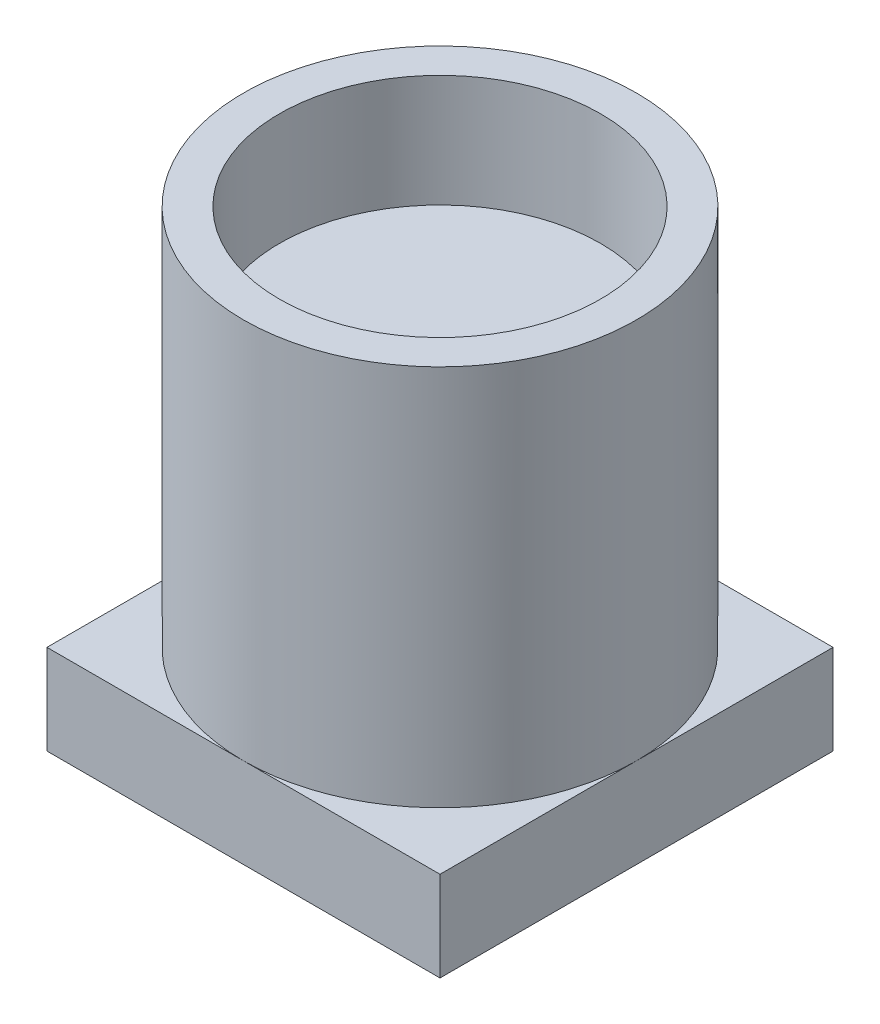
ISO-10303-21;
HEADER;
FILE_DESCRIPTION(('STEP AP214'),'2;1');
FILE_NAME('part.step','',(''),(''),'','','');
FILE_SCHEMA(('AUTOMOTIVE_DESIGN { 1 0 10303 214 1 1 1 1 }'));
ENDSEC;
DATA;
#1=APPLICATION_CONTEXT('core data for automotive mechanical design processes');
#2=APPLICATION_PROTOCOL_DEFINITION('international standard','automotive_design',2000,#1);
#3=PRODUCT_CONTEXT('',#1,'mechanical');
#4=PRODUCT('Part','Part','',(#3));
#5=PRODUCT_RELATED_PRODUCT_CATEGORY('part','',(#4));
#6=PRODUCT_DEFINITION_FORMATION('','',#4);
#7=PRODUCT_DEFINITION_CONTEXT('part definition',#1,'design');
#8=PRODUCT_DEFINITION('design','',#6,#7);
#9=PRODUCT_DEFINITION_SHAPE('','',#8);
#10=(LENGTH_UNIT() NAMED_UNIT(*) SI_UNIT(.MILLI.,.METRE.));
#11=(NAMED_UNIT(*) PLANE_ANGLE_UNIT() SI_UNIT($,.RADIAN.));
#12=(NAMED_UNIT(*) SI_UNIT($,.STERADIAN.) SOLID_ANGLE_UNIT());
#13=UNCERTAINTY_MEASURE_WITH_UNIT(LENGTH_MEASURE(1.E-05),#10,'distance_accuracy_value','');
#14=(GEOMETRIC_REPRESENTATION_CONTEXT(3) GLOBAL_UNCERTAINTY_ASSIGNED_CONTEXT((#13)) GLOBAL_UNIT_ASSIGNED_CONTEXT((#10,
#11,#12)) REPRESENTATION_CONTEXT('',''));
#15=CARTESIAN_POINT('',(0.,0.,0.));
#16=DIRECTION('',(0.,0.,1.));
#17=DIRECTION('',(1.,0.,0.));
#18=AXIS2_PLACEMENT_3D('',#15,#16,#17);
#19=CARTESIAN_POINT('',(0.,0.8,0.));
#20=DIRECTION('',(0.,-1.,0.));
#21=DIRECTION('',(0.,0.,-1.));
#22=AXIS2_PLACEMENT_3D('',#19,#20,#21);
#23=PLANE('',#22);
#24=CARTESIAN_POINT('',(0.,0.8,0.));
#25=DIRECTION('',(0.,1.,0.));
#26=DIRECTION('',(0.,0.,1.));
#27=AXIS2_PLACEMENT_3D('',#24,#25,#26);
#28=CIRCLE('',#27,1.75);
#29=CARTESIAN_POINT('',(0.,0.8,1.75));
#30=VERTEX_POINT('',#29);
#31=CARTESIAN_POINT('',(1.75,0.8,0.));
#32=VERTEX_POINT('',#31);
#33=EDGE_CURVE('E44',#30,#32,#28,.T.);
#34=ORIENTED_EDGE('',*,*,#33,.F.);
#35=DIRECTION('',(1.,0.,0.));
#36=VECTOR('',#35,1.);
#37=CARTESIAN_POINT('',(-1.75,0.8,1.75));
#38=LINE('',#37,#36);
#39=CARTESIAN_POINT('',(1.75,0.8,1.75));
#40=VERTEX_POINT('',#39);
#41=EDGE_CURVE('E98',#30,#40,#38,.T.);
#42=ORIENTED_EDGE('',*,*,#41,.T.);
#43=DIRECTION('',(0.,0.,-1.));
#44=VECTOR('',#43,1.);
#45=CARTESIAN_POINT('',(1.75,0.8,1.75));
#46=LINE('',#45,#44);
#47=EDGE_CURVE('E110',#40,#32,#46,.T.);
#48=ORIENTED_EDGE('',*,*,#47,.T.);
#49=EDGE_LOOP('',(#34,#42,#48));
#50=FACE_BOUND('',#49,.T.);
#51=ADVANCED_FACE('F33',(#50),#23,.F.);
#52=CARTESIAN_POINT('',(0.,0.8,-1.75));
#53=VERTEX_POINT('',#52);
#54=EDGE_CURVE('E11',#32,#53,#28,.T.);
#55=ORIENTED_EDGE('',*,*,#54,.F.);
#56=CARTESIAN_POINT('',(1.75,0.8,-1.75));
#57=VERTEX_POINT('',#56);
#58=EDGE_CURVE('E97',#32,#57,#46,.T.);
#59=ORIENTED_EDGE('',*,*,#58,.T.);
#60=DIRECTION('',(-1.,0.,0.));
#61=VECTOR('',#60,1.);
#62=CARTESIAN_POINT('',(-1.75,0.8,-1.75));
#63=LINE('',#62,#61);
#64=EDGE_CURVE('E121',#57,#53,#63,.T.);
#65=ORIENTED_EDGE('',*,*,#64,.T.);
#66=EDGE_LOOP('',(#55,#59,#65));
#67=FACE_BOUND('',#66,.T.);
#68=ADVANCED_FACE('F152',(#67),#23,.F.);
#69=CARTESIAN_POINT('',(-1.75,0.8,0.));
#70=VERTEX_POINT('',#69);
#71=EDGE_CURVE('E42',#53,#70,#28,.T.);
#72=ORIENTED_EDGE('',*,*,#71,.F.);
#73=CARTESIAN_POINT('',(-1.75,0.8,-1.75));
#74=VERTEX_POINT('',#73);
#75=EDGE_CURVE('E120',#53,#74,#63,.T.);
#76=ORIENTED_EDGE('',*,*,#75,.T.);
#77=DIRECTION('',(0.,0.,1.));
#78=VECTOR('',#77,1.);
#79=CARTESIAN_POINT('',(-1.75,0.8,1.75));
#80=LINE('',#79,#78);
#81=EDGE_CURVE('E108',#74,#70,#80,.T.);
#82=ORIENTED_EDGE('',*,*,#81,.T.);
#83=EDGE_LOOP('',(#72,#76,#82));
#84=FACE_BOUND('',#83,.T.);
#85=ADVANCED_FACE('F151',(#84),#23,.F.);
#86=EDGE_CURVE('E91',#70,#30,#28,.T.);
#87=ORIENTED_EDGE('',*,*,#86,.F.);
#88=CARTESIAN_POINT('',(-1.75,0.8,1.75));
#89=VERTEX_POINT('',#88);
#90=EDGE_CURVE('E93',#70,#89,#80,.T.);
#91=ORIENTED_EDGE('',*,*,#90,.T.);
#92=EDGE_CURVE('E87',#89,#30,#38,.T.);
#93=ORIENTED_EDGE('',*,*,#92,.T.);
#94=EDGE_LOOP('',(#87,#91,#93));
#95=FACE_BOUND('',#94,.T.);
#96=ADVANCED_FACE('F89',(#95),#23,.F.);
#97=CARTESIAN_POINT('',(-1.75,0.8,1.75));
#98=DIRECTION('',(1.,0.,0.));
#99=DIRECTION('',(0.,0.,-1.));
#100=AXIS2_PLACEMENT_3D('',#97,#98,#99);
#101=PLANE('',#100);
#102=DIRECTION('',(0.,0.,1.));
#103=VECTOR('',#102,1.);
#104=CARTESIAN_POINT('',(-1.75,0.,1.75));
#105=LINE('',#104,#103);
#106=CARTESIAN_POINT('',(-1.75,0.,-1.75));
#107=VERTEX_POINT('',#106);
#108=CARTESIAN_POINT('',(-1.75,0.,1.75));
#109=VERTEX_POINT('',#108);
#110=EDGE_CURVE('E124',#107,#109,#105,.T.);
#111=ORIENTED_EDGE('',*,*,#110,.T.);
#112=DIRECTION('',(0.,-1.,0.));
#113=VECTOR('',#112,1.);
#114=CARTESIAN_POINT('',(-1.75,0.8,1.75));
#115=LINE('',#114,#113);
#116=EDGE_CURVE('E37',#89,#109,#115,.T.);
#117=ORIENTED_EDGE('',*,*,#116,.F.);
#118=ORIENTED_EDGE('',*,*,#90,.F.);
#119=ORIENTED_EDGE('',*,*,#81,.F.);
#120=DIRECTION('',(0.,-1.,0.));
#121=VECTOR('',#120,1.);
#122=CARTESIAN_POINT('',(-1.75,0.8,-1.75));
#123=LINE('',#122,#121);
#124=EDGE_CURVE('E123',#74,#107,#123,.T.);
#125=ORIENTED_EDGE('',*,*,#124,.T.);
#126=EDGE_LOOP('',(#111,#117,#118,#119,#125));
#127=FACE_BOUND('',#126,.T.);
#128=ADVANCED_FACE('F35',(#127),#101,.F.);
#129=CARTESIAN_POINT('',(-1.75,0.8,1.75));
#130=DIRECTION('',(0.,0.,-1.));
#131=DIRECTION('',(-1.,0.,0.));
#132=AXIS2_PLACEMENT_3D('',#129,#130,#131);
#133=PLANE('',#132);
#134=DIRECTION('',(1.,0.,0.));
#135=VECTOR('',#134,1.);
#136=CARTESIAN_POINT('',(-1.75,0.,1.75));
#137=LINE('',#136,#135);
#138=CARTESIAN_POINT('',(1.75,0.,1.75));
#139=VERTEX_POINT('',#138);
#140=EDGE_CURVE('E127',#109,#139,#137,.T.);
#141=ORIENTED_EDGE('',*,*,#140,.T.);
#142=DIRECTION('',(0.,-1.,0.));
#143=VECTOR('',#142,1.);
#144=CARTESIAN_POINT('',(1.75,0.8,1.75));
#145=LINE('',#144,#143);
#146=EDGE_CURVE('E104',#40,#139,#145,.T.);
#147=ORIENTED_EDGE('',*,*,#146,.F.);
#148=ORIENTED_EDGE('',*,*,#41,.F.);
#149=ORIENTED_EDGE('',*,*,#92,.F.);
#150=ORIENTED_EDGE('',*,*,#116,.T.);
#151=EDGE_LOOP('',(#141,#147,#148,#149,#150));
#152=FACE_BOUND('',#151,.T.);
#153=ADVANCED_FACE('F102',(#152),#133,.F.);
#154=CARTESIAN_POINT('',(1.75,0.8,1.75));
#155=DIRECTION('',(-1.,0.,0.));
#156=DIRECTION('',(0.,0.,1.));
#157=AXIS2_PLACEMENT_3D('',#154,#155,#156);
#158=PLANE('',#157);
#159=DIRECTION('',(0.,0.,-1.));
#160=VECTOR('',#159,1.);
#161=CARTESIAN_POINT('',(1.75,0.,1.75));
#162=LINE('',#161,#160);
#163=CARTESIAN_POINT('',(1.75,0.,-1.75));
#164=VERTEX_POINT('',#163);
#165=EDGE_CURVE('E129',#139,#164,#162,.T.);
#166=ORIENTED_EDGE('',*,*,#165,.T.);
#167=DIRECTION('',(0.,-1.,0.));
#168=VECTOR('',#167,1.);
#169=CARTESIAN_POINT('',(1.75,0.8,-1.75));
#170=LINE('',#169,#168);
#171=EDGE_CURVE('E135',#57,#164,#170,.T.);
#172=ORIENTED_EDGE('',*,*,#171,.F.);
#173=ORIENTED_EDGE('',*,*,#58,.F.);
#174=ORIENTED_EDGE('',*,*,#47,.F.);
#175=ORIENTED_EDGE('',*,*,#146,.T.);
#176=EDGE_LOOP('',(#166,#172,#173,#174,#175));
#177=FACE_BOUND('',#176,.T.);
#178=ADVANCED_FACE('F139',(#177),#158,.F.);
#179=CARTESIAN_POINT('',(-1.75,0.8,-1.75));
#180=DIRECTION('',(0.,0.,1.));
#181=DIRECTION('',(1.,0.,0.));
#182=AXIS2_PLACEMENT_3D('',#179,#180,#181);
#183=PLANE('',#182);
#184=DIRECTION('',(-1.,0.,0.));
#185=VECTOR('',#184,1.);
#186=CARTESIAN_POINT('',(-1.75,0.,-1.75));
#187=LINE('',#186,#185);
#188=EDGE_CURVE('E131',#164,#107,#187,.T.);
#189=ORIENTED_EDGE('',*,*,#188,.T.);
#190=ORIENTED_EDGE('',*,*,#124,.F.);
#191=ORIENTED_EDGE('',*,*,#75,.F.);
#192=ORIENTED_EDGE('',*,*,#64,.F.);
#193=ORIENTED_EDGE('',*,*,#171,.T.);
#194=EDGE_LOOP('',(#189,#190,#191,#192,#193));
#195=FACE_BOUND('',#194,.T.);
#196=ADVANCED_FACE('F147',(#195),#183,.F.);
#197=CARTESIAN_POINT('',(0.,0.,0.));
#198=DIRECTION('',(0.,-1.,0.));
#199=DIRECTION('',(0.,0.,-1.));
#200=AXIS2_PLACEMENT_3D('',#197,#198,#199);
#201=PLANE('',#200);
#202=ORIENTED_EDGE('',*,*,#110,.F.);
#203=ORIENTED_EDGE('',*,*,#188,.F.);
#204=ORIENTED_EDGE('',*,*,#165,.F.);
#205=ORIENTED_EDGE('',*,*,#140,.F.);
#206=EDGE_LOOP('',(#202,#203,#204,#205));
#207=FACE_BOUND('',#206,.T.);
#208=ADVANCED_FACE('F144',(#207),#201,.T.);
#209=CARTESIAN_POINT('',(0.,4.2,0.));
#210=DIRECTION('',(0.,-1.,0.));
#211=DIRECTION('',(0.,0.,-1.));
#212=AXIS2_PLACEMENT_3D('',#209,#210,#211);
#213=CYLINDRICAL_SURFACE('',#212,1.75);
#214=CARTESIAN_POINT('',(0.,4.2,0.));
#215=DIRECTION('',(0.,1.,0.));
#216=DIRECTION('',(0.,0.,1.));
#217=AXIS2_PLACEMENT_3D('',#214,#215,#216);
#218=CIRCLE('',#217,1.75);
#219=CARTESIAN_POINT('',(0.,4.2,1.75));
#220=VERTEX_POINT('',#219);
#221=EDGE_CURVE('E112',#220,#220,#218,.T.);
#222=ORIENTED_EDGE('',*,*,#221,.F.);
#223=EDGE_LOOP('',(#222));
#224=FACE_BOUND('',#223,.T.);
#225=ORIENTED_EDGE('',*,*,#33,.T.);
#226=ORIENTED_EDGE('',*,*,#54,.T.);
#227=ORIENTED_EDGE('',*,*,#71,.T.);
#228=ORIENTED_EDGE('',*,*,#86,.T.);
#229=EDGE_LOOP('',(#225,#226,#227,#228));
#230=FACE_BOUND('',#229,.T.);
#231=ADVANCED_FACE('F114',(#224,#230),#213,.T.);
#232=CARTESIAN_POINT('',(0.,4.2,0.));
#233=DIRECTION('',(0.,1.,0.));
#234=DIRECTION('',(0.,0.,1.));
#235=AXIS2_PLACEMENT_3D('',#232,#233,#234);
#236=PLANE('',#235);
#237=CARTESIAN_POINT('',(0.,4.2,0.));
#238=DIRECTION('',(0.,1.,0.));
#239=DIRECTION('',(0.,0.,1.));
#240=AXIS2_PLACEMENT_3D('',#237,#238,#239);
#241=CIRCLE('',#240,1.43);
#242=CARTESIAN_POINT('',(0.,4.2,1.43));
#243=VERTEX_POINT('',#242);
#244=EDGE_CURVE('E242',#243,#243,#241,.T.);
#245=ORIENTED_EDGE('',*,*,#244,.F.);
#246=EDGE_LOOP('',(#245));
#247=FACE_BOUND('',#246,.T.);
#248=ORIENTED_EDGE('',*,*,#221,.T.);
#249=EDGE_LOOP('',(#248));
#250=FACE_BOUND('',#249,.T.);
#251=ADVANCED_FACE('F208',(#247,#250),#236,.T.);
#252=CARTESIAN_POINT('',(0.,3.2,0.));
#253=DIRECTION('',(0.,1.,0.));
#254=DIRECTION('',(0.,0.,1.));
#255=AXIS2_PLACEMENT_3D('',#252,#253,#254);
#256=CYLINDRICAL_SURFACE('',#255,1.43);
#257=CARTESIAN_POINT('',(0.,3.2,0.));
#258=DIRECTION('',(0.,1.,0.));
#259=DIRECTION('',(0.,0.,1.));
#260=AXIS2_PLACEMENT_3D('',#257,#258,#259);
#261=CIRCLE('',#260,1.43);
#262=CARTESIAN_POINT('',(0.,3.2,1.43));
#263=VERTEX_POINT('',#262);
#264=EDGE_CURVE('E113',#263,#263,#261,.T.);
#265=ORIENTED_EDGE('',*,*,#264,.F.);
#266=EDGE_LOOP('',(#265));
#267=FACE_BOUND('',#266,.T.);
#268=ORIENTED_EDGE('',*,*,#244,.T.);
#269=EDGE_LOOP('',(#268));
#270=FACE_BOUND('',#269,.T.);
#271=ADVANCED_FACE('F214',(#267,#270),#256,.F.);
#272=CARTESIAN_POINT('',(0.,3.2,0.));
#273=DIRECTION('',(0.,1.,0.));
#274=DIRECTION('',(0.,0.,1.));
#275=AXIS2_PLACEMENT_3D('',#272,#273,#274);
#276=PLANE('',#275);
#277=ORIENTED_EDGE('',*,*,#264,.T.);
#278=EDGE_LOOP('',(#277));
#279=FACE_BOUND('',#278,.T.);
#280=ADVANCED_FACE('F221',(#279),#276,.T.);
#281=CLOSED_SHELL('',(#51,#68,#85,#96,#128,#153,#178,#196,#208,#231,#251,#271,#280));
#282=MANIFOLD_SOLID_BREP('B2',#281);
#283=ADVANCED_BREP_SHAPE_REPRESENTATION('',(#18,#282),#14);
#284=SHAPE_DEFINITION_REPRESENTATION(#9,#283);
ENDSEC;
END-ISO-10303-21;
